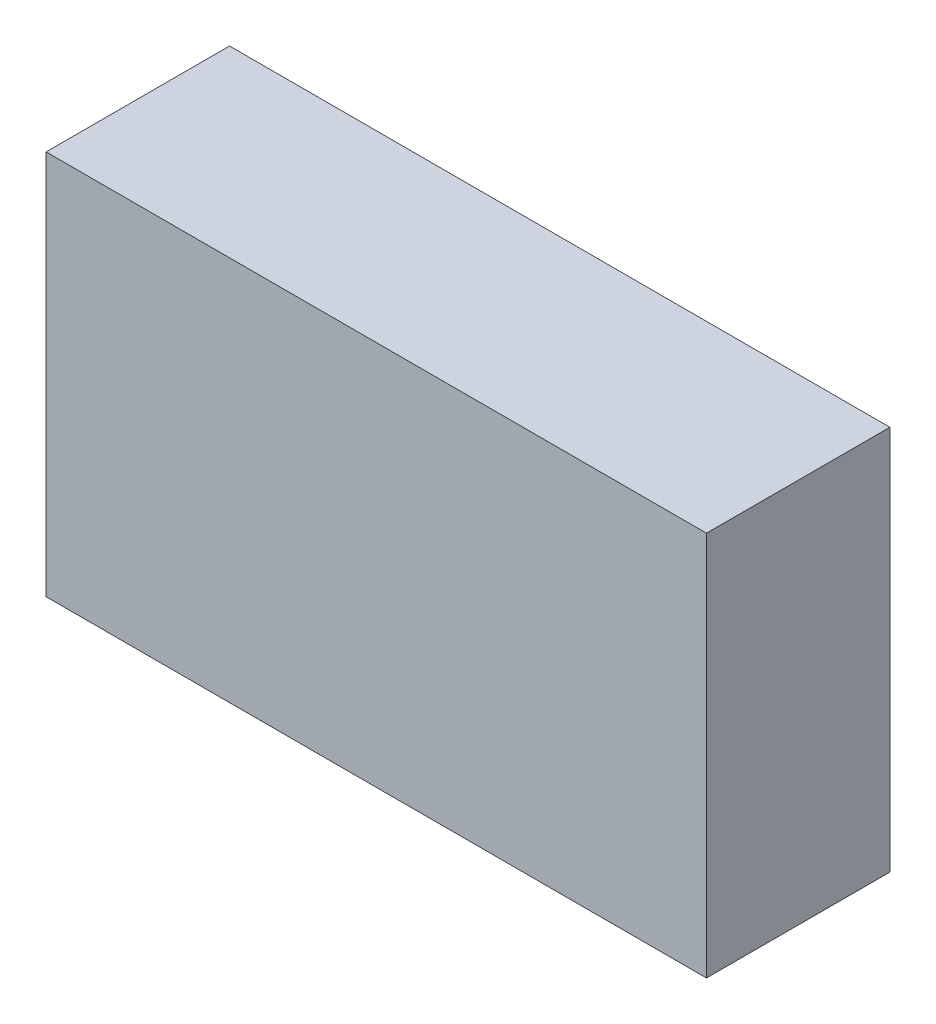
ISO-10303-21;
HEADER;
FILE_DESCRIPTION(('STEP AP214'),'2;1');
FILE_NAME('part.step','',(''),(''),'','','');
FILE_SCHEMA(('AUTOMOTIVE_DESIGN { 1 0 10303 214 1 1 1 1 }'));
ENDSEC;
DATA;
#1=APPLICATION_CONTEXT('core data for automotive mechanical design processes');
#2=APPLICATION_PROTOCOL_DEFINITION('international standard','automotive_design',2000,#1);
#3=PRODUCT_CONTEXT('',#1,'mechanical');
#4=PRODUCT('Part','Part','',(#3));
#5=PRODUCT_RELATED_PRODUCT_CATEGORY('part','',(#4));
#6=PRODUCT_DEFINITION_FORMATION('','',#4);
#7=PRODUCT_DEFINITION_CONTEXT('part definition',#1,'design');
#8=PRODUCT_DEFINITION('design','',#6,#7);
#9=PRODUCT_DEFINITION_SHAPE('','',#8);
#10=(LENGTH_UNIT() NAMED_UNIT(*) SI_UNIT(.MILLI.,.METRE.));
#11=(NAMED_UNIT(*) PLANE_ANGLE_UNIT() SI_UNIT($,.RADIAN.));
#12=(NAMED_UNIT(*) SI_UNIT($,.STERADIAN.) SOLID_ANGLE_UNIT());
#13=UNCERTAINTY_MEASURE_WITH_UNIT(LENGTH_MEASURE(1.E-05),#10,'distance_accuracy_value','');
#14=(GEOMETRIC_REPRESENTATION_CONTEXT(3) GLOBAL_UNCERTAINTY_ASSIGNED_CONTEXT((#13)) GLOBAL_UNIT_ASSIGNED_CONTEXT((#10,
#11,#12)) REPRESENTATION_CONTEXT('',''));
#15=CARTESIAN_POINT('',(0.,0.,0.));
#16=DIRECTION('',(0.,0.,1.));
#17=DIRECTION('',(1.,0.,0.));
#18=AXIS2_PLACEMENT_3D('',#15,#16,#17);
#19=CARTESIAN_POINT('',(-18.,0.,10.));
#20=DIRECTION('',(-1.,0.,0.));
#21=DIRECTION('',(0.,0.,1.));
#22=AXIS2_PLACEMENT_3D('',#19,#20,#21);
#23=PLANE('',#22);
#24=DIRECTION('',(0.,1.,0.));
#25=VECTOR('',#24,1.);
#26=CARTESIAN_POINT('',(-18.,0.,0.));
#27=LINE('',#26,#25);
#28=CARTESIAN_POINT('',(-18.,-10.5,0.));
#29=VERTEX_POINT('',#28);
#30=CARTESIAN_POINT('',(-18.,10.5,0.));
#31=VERTEX_POINT('',#30);
#32=EDGE_CURVE('E96',#29,#31,#27,.T.);
#33=ORIENTED_EDGE('',*,*,#32,.F.);
#34=DIRECTION('',(0.,0.,-1.));
#35=VECTOR('',#34,1.);
#36=CARTESIAN_POINT('',(-18.,-10.5,10.));
#37=LINE('',#36,#35);
#38=CARTESIAN_POINT('',(-18.,-10.5,10.));
#39=VERTEX_POINT('',#38);
#40=EDGE_CURVE('E11',#39,#29,#37,.T.);
#41=ORIENTED_EDGE('',*,*,#40,.F.);
#42=DIRECTION('',(0.,1.,0.));
#43=VECTOR('',#42,1.);
#44=CARTESIAN_POINT('',(-18.,0.,10.));
#45=LINE('',#44,#43);
#46=CARTESIAN_POINT('',(-18.,10.5,10.));
#47=VERTEX_POINT('',#46);
#48=EDGE_CURVE('E90',#39,#47,#45,.T.);
#49=ORIENTED_EDGE('',*,*,#48,.T.);
#50=DIRECTION('',(0.,0.,-1.));
#51=VECTOR('',#50,1.);
#52=CARTESIAN_POINT('',(-18.,10.5,10.));
#53=LINE('',#52,#51);
#54=EDGE_CURVE('E71',#47,#31,#53,.T.);
#55=ORIENTED_EDGE('',*,*,#54,.T.);
#56=EDGE_LOOP('',(#33,#41,#49,#55));
#57=FACE_BOUND('',#56,.T.);
#58=ADVANCED_FACE('F33',(#57),#23,.T.);
#59=CARTESIAN_POINT('',(0.,-10.5,10.));
#60=DIRECTION('',(0.,-1.,0.));
#61=DIRECTION('',(0.,0.,-1.));
#62=AXIS2_PLACEMENT_3D('',#59,#60,#61);
#63=PLANE('',#62);
#64=DIRECTION('',(-1.,0.,0.));
#65=VECTOR('',#64,1.);
#66=CARTESIAN_POINT('',(0.,-10.5,0.));
#67=LINE('',#66,#65);
#68=CARTESIAN_POINT('',(18.,-10.5,0.));
#69=VERTEX_POINT('',#68);
#70=EDGE_CURVE('E84',#69,#29,#67,.T.);
#71=ORIENTED_EDGE('',*,*,#70,.F.);
#72=DIRECTION('',(0.,0.,-1.));
#73=VECTOR('',#72,1.);
#74=CARTESIAN_POINT('',(18.,-10.5,10.));
#75=LINE('',#74,#73);
#76=CARTESIAN_POINT('',(18.,-10.5,10.));
#77=VERTEX_POINT('',#76);
#78=EDGE_CURVE('E41',#77,#69,#75,.T.);
#79=ORIENTED_EDGE('',*,*,#78,.F.);
#80=DIRECTION('',(-1.,0.,0.));
#81=VECTOR('',#80,1.);
#82=CARTESIAN_POINT('',(0.,-10.5,10.));
#83=LINE('',#82,#81);
#84=EDGE_CURVE('E82',#77,#39,#83,.T.);
#85=ORIENTED_EDGE('',*,*,#84,.T.);
#86=ORIENTED_EDGE('',*,*,#40,.T.);
#87=EDGE_LOOP('',(#71,#79,#85,#86));
#88=FACE_BOUND('',#87,.T.);
#89=ADVANCED_FACE('F80',(#88),#63,.T.);
#90=CARTESIAN_POINT('',(18.,0.,10.));
#91=DIRECTION('',(-1.,0.,0.));
#92=DIRECTION('',(0.,0.,1.));
#93=AXIS2_PLACEMENT_3D('',#90,#91,#92);
#94=PLANE('',#93);
#95=DIRECTION('',(0.,1.,0.));
#96=VECTOR('',#95,1.);
#97=CARTESIAN_POINT('',(18.,0.,0.));
#98=LINE('',#97,#96);
#99=CARTESIAN_POINT('',(18.,10.5,0.));
#100=VERTEX_POINT('',#99);
#101=EDGE_CURVE('E64',#69,#100,#98,.T.);
#102=ORIENTED_EDGE('',*,*,#101,.T.);
#103=DIRECTION('',(0.,0.,-1.));
#104=VECTOR('',#103,1.);
#105=CARTESIAN_POINT('',(18.,10.5,10.));
#106=LINE('',#105,#104);
#107=CARTESIAN_POINT('',(18.,10.5,10.));
#108=VERTEX_POINT('',#107);
#109=EDGE_CURVE('E85',#108,#100,#106,.T.);
#110=ORIENTED_EDGE('',*,*,#109,.F.);
#111=DIRECTION('',(0.,1.,0.));
#112=VECTOR('',#111,1.);
#113=CARTESIAN_POINT('',(18.,0.,10.));
#114=LINE('',#113,#112);
#115=EDGE_CURVE('E86',#77,#108,#114,.T.);
#116=ORIENTED_EDGE('',*,*,#115,.F.);
#117=ORIENTED_EDGE('',*,*,#78,.T.);
#118=EDGE_LOOP('',(#102,#110,#116,#117));
#119=FACE_BOUND('',#118,.T.);
#120=ADVANCED_FACE('F87',(#119),#94,.F.);
#121=CARTESIAN_POINT('',(0.,10.5,10.));
#122=DIRECTION('',(0.,-1.,0.));
#123=DIRECTION('',(0.,0.,-1.));
#124=AXIS2_PLACEMENT_3D('',#121,#122,#123);
#125=PLANE('',#124);
#126=DIRECTION('',(-1.,0.,0.));
#127=VECTOR('',#126,1.);
#128=CARTESIAN_POINT('',(0.,10.5,0.));
#129=LINE('',#128,#127);
#130=EDGE_CURVE('E92',#100,#31,#129,.T.);
#131=ORIENTED_EDGE('',*,*,#130,.T.);
#132=ORIENTED_EDGE('',*,*,#54,.F.);
#133=DIRECTION('',(-1.,0.,0.));
#134=VECTOR('',#133,1.);
#135=CARTESIAN_POINT('',(0.,10.5,10.));
#136=LINE('',#135,#134);
#137=EDGE_CURVE('E49',#108,#47,#136,.T.);
#138=ORIENTED_EDGE('',*,*,#137,.F.);
#139=ORIENTED_EDGE('',*,*,#109,.T.);
#140=EDGE_LOOP('',(#131,#132,#138,#139));
#141=FACE_BOUND('',#140,.T.);
#142=ADVANCED_FACE('F105',(#141),#125,.F.);
#143=CARTESIAN_POINT('',(0.,0.,10.));
#144=DIRECTION('',(0.,0.,1.));
#145=DIRECTION('',(1.,0.,0.));
#146=AXIS2_PLACEMENT_3D('',#143,#144,#145);
#147=PLANE('',#146);
#148=ORIENTED_EDGE('',*,*,#48,.F.);
#149=ORIENTED_EDGE('',*,*,#84,.F.);
#150=ORIENTED_EDGE('',*,*,#115,.T.);
#151=ORIENTED_EDGE('',*,*,#137,.T.);
#152=EDGE_LOOP('',(#148,#149,#150,#151));
#153=FACE_BOUND('',#152,.T.);
#154=ADVANCED_FACE('F89',(#153),#147,.T.);
#155=CARTESIAN_POINT('',(0.,0.,0.));
#156=DIRECTION('',(0.,0.,1.));
#157=DIRECTION('',(1.,0.,0.));
#158=AXIS2_PLACEMENT_3D('',#155,#156,#157);
#159=PLANE('',#158);
#160=ORIENTED_EDGE('',*,*,#32,.T.);
#161=ORIENTED_EDGE('',*,*,#130,.F.);
#162=ORIENTED_EDGE('',*,*,#101,.F.);
#163=ORIENTED_EDGE('',*,*,#70,.T.);
#164=EDGE_LOOP('',(#160,#161,#162,#163));
#165=FACE_BOUND('',#164,.T.);
#166=ADVANCED_FACE('F107',(#165),#159,.F.);
#167=CLOSED_SHELL('',(#58,#89,#120,#142,#154,#166));
#168=MANIFOLD_SOLID_BREP('B2',#167);
#169=ADVANCED_BREP_SHAPE_REPRESENTATION('',(#18,#168),#14);
#170=SHAPE_DEFINITION_REPRESENTATION(#9,#169);
ENDSEC;
END-ISO-10303-21;
